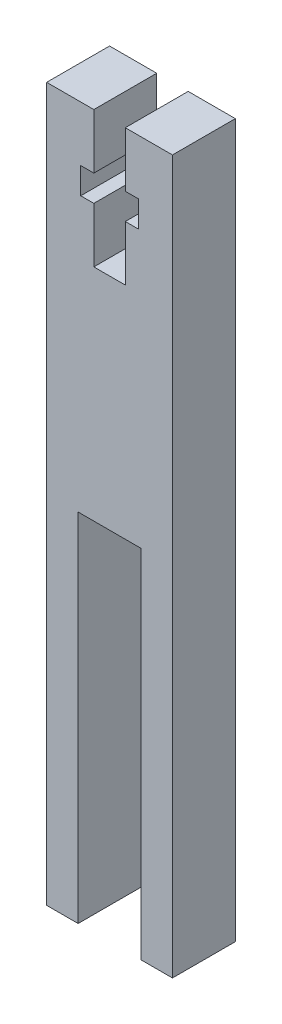
ISO-10303-21;
HEADER;
FILE_DESCRIPTION(('STEP AP214'),'2;1');
FILE_NAME('part.step','',(''),(''),'','','');
FILE_SCHEMA(('AUTOMOTIVE_DESIGN { 1 0 10303 214 1 1 1 1 }'));
ENDSEC;
DATA;
#1=APPLICATION_CONTEXT('core data for automotive mechanical design processes');
#2=APPLICATION_PROTOCOL_DEFINITION('international standard','automotive_design',2000,#1);
#3=PRODUCT_CONTEXT('',#1,'mechanical');
#4=PRODUCT('Part','Part','',(#3));
#5=PRODUCT_RELATED_PRODUCT_CATEGORY('part','',(#4));
#6=PRODUCT_DEFINITION_FORMATION('','',#4);
#7=PRODUCT_DEFINITION_CONTEXT('part definition',#1,'design');
#8=PRODUCT_DEFINITION('design','',#6,#7);
#9=PRODUCT_DEFINITION_SHAPE('','',#8);
#10=(LENGTH_UNIT() NAMED_UNIT(*) SI_UNIT(.MILLI.,.METRE.));
#11=(NAMED_UNIT(*) PLANE_ANGLE_UNIT() SI_UNIT($,.RADIAN.));
#12=(NAMED_UNIT(*) SI_UNIT($,.STERADIAN.) SOLID_ANGLE_UNIT());
#13=UNCERTAINTY_MEASURE_WITH_UNIT(LENGTH_MEASURE(1.E-05),#10,'distance_accuracy_value','');
#14=(GEOMETRIC_REPRESENTATION_CONTEXT(3) GLOBAL_UNCERTAINTY_ASSIGNED_CONTEXT((#13)) GLOBAL_UNIT_ASSIGNED_CONTEXT((#10,
#11,#12)) REPRESENTATION_CONTEXT('',''));
#15=CARTESIAN_POINT('',(0.,0.,0.));
#16=DIRECTION('',(0.,0.,1.));
#17=DIRECTION('',(1.,0.,0.));
#18=AXIS2_PLACEMENT_3D('',#15,#16,#17);
#19=CARTESIAN_POINT('',(-1.5,68.,6.));
#20=DIRECTION('',(0.,-1.,0.));
#21=DIRECTION('',(1.,0.,0.));
#22=AXIS2_PLACEMENT_3D('',#19,#20,#21);
#23=PLANE('',#22);
#24=DIRECTION('',(-1.,0.,0.));
#25=VECTOR('',#24,1.);
#26=CARTESIAN_POINT('',(-1.5,68.,0.));
#27=LINE('',#26,#25);
#28=CARTESIAN_POINT('',(-1.5,68.,0.));
#29=VERTEX_POINT('',#28);
#30=CARTESIAN_POINT('',(-6.,68.,0.));
#31=VERTEX_POINT('',#30);
#32=EDGE_CURVE('E212',#29,#31,#27,.T.);
#33=ORIENTED_EDGE('',*,*,#32,.T.);
#34=DIRECTION('',(0.,0.,-1.));
#35=VECTOR('',#34,1.);
#36=CARTESIAN_POINT('',(-6.,68.,6.));
#37=LINE('',#36,#35);
#38=CARTESIAN_POINT('',(-6.,68.,6.));
#39=VERTEX_POINT('',#38);
#40=EDGE_CURVE('E11',#39,#31,#37,.T.);
#41=ORIENTED_EDGE('',*,*,#40,.F.);
#42=DIRECTION('',(-1.,0.,0.));
#43=VECTOR('',#42,1.);
#44=CARTESIAN_POINT('',(-1.5,68.,6.));
#45=LINE('',#44,#43);
#46=CARTESIAN_POINT('',(-1.5,68.,6.));
#47=VERTEX_POINT('',#46);
#48=EDGE_CURVE('E270',#47,#39,#45,.T.);
#49=ORIENTED_EDGE('',*,*,#48,.F.);
#50=DIRECTION('',(0.,0.,-1.));
#51=VECTOR('',#50,1.);
#52=CARTESIAN_POINT('',(-1.5,68.,6.));
#53=LINE('',#52,#51);
#54=EDGE_CURVE('E208',#47,#29,#53,.T.);
#55=ORIENTED_EDGE('',*,*,#54,.T.);
#56=EDGE_LOOP('',(#33,#41,#49,#55));
#57=FACE_BOUND('',#56,.T.);
#58=ADVANCED_FACE('F39',(#57),#23,.F.);
#59=CARTESIAN_POINT('',(-6.,68.,6.));
#60=DIRECTION('',(1.,0.,0.));
#61=DIRECTION('',(0.,1.,0.));
#62=AXIS2_PLACEMENT_3D('',#59,#60,#61);
#63=PLANE('',#62);
#64=DIRECTION('',(0.,-1.,0.));
#65=VECTOR('',#64,1.);
#66=CARTESIAN_POINT('',(-6.,68.,0.));
#67=LINE('',#66,#65);
#68=CARTESIAN_POINT('',(-5.99999999999999,0.,0.));
#69=VERTEX_POINT('',#68);
#70=EDGE_CURVE('E216',#31,#69,#67,.T.);
#71=ORIENTED_EDGE('',*,*,#70,.T.);
#72=DIRECTION('',(0.,0.,-1.));
#73=VECTOR('',#72,1.);
#74=CARTESIAN_POINT('',(-5.99999999999999,0.,6.));
#75=LINE('',#74,#73);
#76=CARTESIAN_POINT('',(-5.99999999999999,0.,6.));
#77=VERTEX_POINT('',#76);
#78=EDGE_CURVE('E48',#77,#69,#75,.T.);
#79=ORIENTED_EDGE('',*,*,#78,.F.);
#80=DIRECTION('',(0.,-1.,0.));
#81=VECTOR('',#80,1.);
#82=CARTESIAN_POINT('',(-6.,68.,6.));
#83=LINE('',#82,#81);
#84=EDGE_CURVE('E135',#39,#77,#83,.T.);
#85=ORIENTED_EDGE('',*,*,#84,.F.);
#86=ORIENTED_EDGE('',*,*,#40,.T.);
#87=EDGE_LOOP('',(#71,#79,#85,#86));
#88=FACE_BOUND('',#87,.T.);
#89=ADVANCED_FACE('F420',(#88),#63,.F.);
#90=CARTESIAN_POINT('',(-5.99999999999999,0.,6.));
#91=DIRECTION('',(0.,1.,0.));
#92=DIRECTION('',(0.,0.,1.));
#93=AXIS2_PLACEMENT_3D('',#90,#91,#92);
#94=PLANE('',#93);
#95=DIRECTION('',(1.,0.,0.));
#96=VECTOR('',#95,1.);
#97=CARTESIAN_POINT('',(-5.99999999999999,0.,0.));
#98=LINE('',#97,#96);
#99=CARTESIAN_POINT('',(-3.,0.,0.));
#100=VERTEX_POINT('',#99);
#101=EDGE_CURVE('E219',#69,#100,#98,.T.);
#102=ORIENTED_EDGE('',*,*,#101,.T.);
#103=DIRECTION('',(0.,0.,-1.));
#104=VECTOR('',#103,1.);
#105=CARTESIAN_POINT('',(-3.,0.,6.));
#106=LINE('',#105,#104);
#107=CARTESIAN_POINT('',(-3.,0.,6.));
#108=VERTEX_POINT('',#107);
#109=EDGE_CURVE('E329',#108,#100,#106,.T.);
#110=ORIENTED_EDGE('',*,*,#109,.F.);
#111=DIRECTION('',(1.,0.,0.));
#112=VECTOR('',#111,1.);
#113=CARTESIAN_POINT('',(-5.99999999999999,0.,6.));
#114=LINE('',#113,#112);
#115=EDGE_CURVE('E339',#77,#108,#114,.T.);
#116=ORIENTED_EDGE('',*,*,#115,.F.);
#117=ORIENTED_EDGE('',*,*,#78,.T.);
#118=EDGE_LOOP('',(#102,#110,#116,#117));
#119=FACE_BOUND('',#118,.T.);
#120=ADVANCED_FACE('F337',(#119),#94,.F.);
#121=CARTESIAN_POINT('',(-3.,0.,6.));
#122=DIRECTION('',(-1.,0.,0.));
#123=DIRECTION('',(0.,0.,1.));
#124=AXIS2_PLACEMENT_3D('',#121,#122,#123);
#125=PLANE('',#124);
#126=DIRECTION('',(0.,1.,0.));
#127=VECTOR('',#126,1.);
#128=CARTESIAN_POINT('',(-3.,0.,0.));
#129=LINE('',#128,#127);
#130=CARTESIAN_POINT('',(-3.,34.,0.));
#131=VERTEX_POINT('',#130);
#132=EDGE_CURVE('E222',#100,#131,#129,.T.);
#133=ORIENTED_EDGE('',*,*,#132,.T.);
#134=DIRECTION('',(0.,0.,-1.));
#135=VECTOR('',#134,1.);
#136=CARTESIAN_POINT('',(-3.,34.,6.));
#137=LINE('',#136,#135);
#138=CARTESIAN_POINT('',(-3.,34.,6.));
#139=VERTEX_POINT('',#138);
#140=EDGE_CURVE('E325',#139,#131,#137,.T.);
#141=ORIENTED_EDGE('',*,*,#140,.F.);
#142=DIRECTION('',(0.,1.,0.));
#143=VECTOR('',#142,1.);
#144=CARTESIAN_POINT('',(-3.,0.,6.));
#145=LINE('',#144,#143);
#146=EDGE_CURVE('E358',#108,#139,#145,.T.);
#147=ORIENTED_EDGE('',*,*,#146,.F.);
#148=ORIENTED_EDGE('',*,*,#109,.T.);
#149=EDGE_LOOP('',(#133,#141,#147,#148));
#150=FACE_BOUND('',#149,.T.);
#151=ADVANCED_FACE('F348',(#150),#125,.F.);
#152=CARTESIAN_POINT('',(-3.,34.,6.));
#153=DIRECTION('',(0.,1.,0.));
#154=DIRECTION('',(0.,0.,1.));
#155=AXIS2_PLACEMENT_3D('',#152,#153,#154);
#156=PLANE('',#155);
#157=DIRECTION('',(1.,0.,0.));
#158=VECTOR('',#157,1.);
#159=CARTESIAN_POINT('',(-3.,34.,0.));
#160=LINE('',#159,#158);
#161=CARTESIAN_POINT('',(3.,34.,0.));
#162=VERTEX_POINT('',#161);
#163=EDGE_CURVE('E225',#131,#162,#160,.T.);
#164=ORIENTED_EDGE('',*,*,#163,.T.);
#165=DIRECTION('',(0.,0.,-1.));
#166=VECTOR('',#165,1.);
#167=CARTESIAN_POINT('',(3.,34.,6.));
#168=LINE('',#167,#166);
#169=CARTESIAN_POINT('',(3.,34.,6.));
#170=VERTEX_POINT('',#169);
#171=EDGE_CURVE('E321',#170,#162,#168,.T.);
#172=ORIENTED_EDGE('',*,*,#171,.F.);
#173=DIRECTION('',(1.,0.,0.));
#174=VECTOR('',#173,1.);
#175=CARTESIAN_POINT('',(-3.,34.,6.));
#176=LINE('',#175,#174);
#177=EDGE_CURVE('E354',#139,#170,#176,.T.);
#178=ORIENTED_EDGE('',*,*,#177,.F.);
#179=ORIENTED_EDGE('',*,*,#140,.T.);
#180=EDGE_LOOP('',(#164,#172,#178,#179));
#181=FACE_BOUND('',#180,.T.);
#182=ADVANCED_FACE('F352',(#181),#156,.F.);
#183=CARTESIAN_POINT('',(3.,0.,6.));
#184=DIRECTION('',(1.,0.,0.));
#185=DIRECTION('',(0.,0.,-1.));
#186=AXIS2_PLACEMENT_3D('',#183,#184,#185);
#187=PLANE('',#186);
#188=DIRECTION('',(0.,-1.,0.));
#189=VECTOR('',#188,1.);
#190=CARTESIAN_POINT('',(3.,0.,0.));
#191=LINE('',#190,#189);
#192=CARTESIAN_POINT('',(3.,0.,0.));
#193=VERTEX_POINT('',#192);
#194=EDGE_CURVE('E228',#162,#193,#191,.T.);
#195=ORIENTED_EDGE('',*,*,#194,.T.);
#196=DIRECTION('',(0.,0.,-1.));
#197=VECTOR('',#196,1.);
#198=CARTESIAN_POINT('',(3.,0.,6.));
#199=LINE('',#198,#197);
#200=CARTESIAN_POINT('',(3.,0.,6.));
#201=VERTEX_POINT('',#200);
#202=EDGE_CURVE('E317',#201,#193,#199,.T.);
#203=ORIENTED_EDGE('',*,*,#202,.F.);
#204=DIRECTION('',(0.,-1.,0.));
#205=VECTOR('',#204,1.);
#206=CARTESIAN_POINT('',(3.,0.,6.));
#207=LINE('',#206,#205);
#208=EDGE_CURVE('E357',#170,#201,#207,.T.);
#209=ORIENTED_EDGE('',*,*,#208,.F.);
#210=ORIENTED_EDGE('',*,*,#171,.T.);
#211=EDGE_LOOP('',(#195,#203,#209,#210));
#212=FACE_BOUND('',#211,.T.);
#213=ADVANCED_FACE('F433',(#212),#187,.F.);
#214=CARTESIAN_POINT('',(5.99999999999999,0.,6.));
#215=DIRECTION('',(0.,1.,0.));
#216=DIRECTION('',(0.,0.,1.));
#217=AXIS2_PLACEMENT_3D('',#214,#215,#216);
#218=PLANE('',#217);
#219=DIRECTION('',(1.,0.,0.));
#220=VECTOR('',#219,1.);
#221=CARTESIAN_POINT('',(5.99999999999999,0.,0.));
#222=LINE('',#221,#220);
#223=CARTESIAN_POINT('',(5.99999999999999,0.,0.));
#224=VERTEX_POINT('',#223);
#225=EDGE_CURVE('E231',#193,#224,#222,.T.);
#226=ORIENTED_EDGE('',*,*,#225,.T.);
#227=DIRECTION('',(0.,0.,-1.));
#228=VECTOR('',#227,1.);
#229=CARTESIAN_POINT('',(5.99999999999999,0.,6.));
#230=LINE('',#229,#228);
#231=CARTESIAN_POINT('',(5.99999999999999,0.,6.));
#232=VERTEX_POINT('',#231);
#233=EDGE_CURVE('E313',#232,#224,#230,.T.);
#234=ORIENTED_EDGE('',*,*,#233,.F.);
#235=DIRECTION('',(1.,0.,0.));
#236=VECTOR('',#235,1.);
#237=CARTESIAN_POINT('',(5.99999999999999,0.,6.));
#238=LINE('',#237,#236);
#239=EDGE_CURVE('E362',#201,#232,#238,.T.);
#240=ORIENTED_EDGE('',*,*,#239,.F.);
#241=ORIENTED_EDGE('',*,*,#202,.T.);
#242=EDGE_LOOP('',(#226,#234,#240,#241));
#243=FACE_BOUND('',#242,.T.);
#244=ADVANCED_FACE('F436',(#243),#218,.F.);
#245=CARTESIAN_POINT('',(6.,68.,6.));
#246=DIRECTION('',(-1.,0.,0.));
#247=DIRECTION('',(0.,-1.,0.));
#248=AXIS2_PLACEMENT_3D('',#245,#246,#247);
#249=PLANE('',#248);
#250=DIRECTION('',(0.,1.,0.));
#251=VECTOR('',#250,1.);
#252=CARTESIAN_POINT('',(6.,68.,0.));
#253=LINE('',#252,#251);
#254=CARTESIAN_POINT('',(6.,68.,0.));
#255=VERTEX_POINT('',#254);
#256=EDGE_CURVE('E234',#224,#255,#253,.T.);
#257=ORIENTED_EDGE('',*,*,#256,.T.);
#258=DIRECTION('',(0.,0.,-1.));
#259=VECTOR('',#258,1.);
#260=CARTESIAN_POINT('',(6.,68.,6.));
#261=LINE('',#260,#259);
#262=CARTESIAN_POINT('',(6.,68.,6.));
#263=VERTEX_POINT('',#262);
#264=EDGE_CURVE('E309',#263,#255,#261,.T.);
#265=ORIENTED_EDGE('',*,*,#264,.F.);
#266=DIRECTION('',(0.,1.,0.));
#267=VECTOR('',#266,1.);
#268=CARTESIAN_POINT('',(6.,68.,6.));
#269=LINE('',#268,#267);
#270=EDGE_CURVE('E369',#232,#263,#269,.T.);
#271=ORIENTED_EDGE('',*,*,#270,.F.);
#272=ORIENTED_EDGE('',*,*,#233,.T.);
#273=EDGE_LOOP('',(#257,#265,#271,#272));
#274=FACE_BOUND('',#273,.T.);
#275=ADVANCED_FACE('F440',(#274),#249,.F.);
#276=CARTESIAN_POINT('',(1.5,68.,6.));
#277=DIRECTION('',(0.,-1.,0.));
#278=DIRECTION('',(1.,0.,0.));
#279=AXIS2_PLACEMENT_3D('',#276,#277,#278);
#280=PLANE('',#279);
#281=DIRECTION('',(-1.,0.,0.));
#282=VECTOR('',#281,1.);
#283=CARTESIAN_POINT('',(1.5,68.,0.));
#284=LINE('',#283,#282);
#285=CARTESIAN_POINT('',(1.5,68.,0.));
#286=VERTEX_POINT('',#285);
#287=EDGE_CURVE('E237',#255,#286,#284,.T.);
#288=ORIENTED_EDGE('',*,*,#287,.T.);
#289=DIRECTION('',(0.,0.,-1.));
#290=VECTOR('',#289,1.);
#291=CARTESIAN_POINT('',(1.5,68.,6.));
#292=LINE('',#291,#290);
#293=CARTESIAN_POINT('',(1.5,68.,6.));
#294=VERTEX_POINT('',#293);
#295=EDGE_CURVE('E305',#294,#286,#292,.T.);
#296=ORIENTED_EDGE('',*,*,#295,.F.);
#297=DIRECTION('',(-1.,0.,0.));
#298=VECTOR('',#297,1.);
#299=CARTESIAN_POINT('',(1.5,68.,6.));
#300=LINE('',#299,#298);
#301=EDGE_CURVE('E372',#263,#294,#300,.T.);
#302=ORIENTED_EDGE('',*,*,#301,.F.);
#303=ORIENTED_EDGE('',*,*,#264,.T.);
#304=EDGE_LOOP('',(#288,#296,#302,#303));
#305=FACE_BOUND('',#304,.T.);
#306=ADVANCED_FACE('F444',(#305),#280,.F.);
#307=CARTESIAN_POINT('',(1.5,68.,6.));
#308=DIRECTION('',(1.,0.,0.));
#309=DIRECTION('',(0.,1.,0.));
#310=AXIS2_PLACEMENT_3D('',#307,#308,#309);
#311=PLANE('',#310);
#312=DIRECTION('',(0.,-1.,0.));
#313=VECTOR('',#312,1.);
#314=CARTESIAN_POINT('',(1.5,68.,0.));
#315=LINE('',#314,#313);
#316=CARTESIAN_POINT('',(1.5,62.75,0.));
#317=VERTEX_POINT('',#316);
#318=EDGE_CURVE('E240',#286,#317,#315,.T.);
#319=ORIENTED_EDGE('',*,*,#318,.T.);
#320=DIRECTION('',(0.,0.,-1.));
#321=VECTOR('',#320,1.);
#322=CARTESIAN_POINT('',(1.5,62.75,6.));
#323=LINE('',#322,#321);
#324=CARTESIAN_POINT('',(1.5,62.75,6.));
#325=VERTEX_POINT('',#324);
#326=EDGE_CURVE('E301',#325,#317,#323,.T.);
#327=ORIENTED_EDGE('',*,*,#326,.F.);
#328=DIRECTION('',(0.,-1.,0.));
#329=VECTOR('',#328,1.);
#330=CARTESIAN_POINT('',(1.5,68.,6.));
#331=LINE('',#330,#329);
#332=EDGE_CURVE('E375',#294,#325,#331,.T.);
#333=ORIENTED_EDGE('',*,*,#332,.F.);
#334=ORIENTED_EDGE('',*,*,#295,.T.);
#335=EDGE_LOOP('',(#319,#327,#333,#334));
#336=FACE_BOUND('',#335,.T.);
#337=ADVANCED_FACE('F448',(#336),#311,.F.);
#338=CARTESIAN_POINT('',(1.5,62.75,6.));
#339=DIRECTION('',(0.,1.,0.));
#340=DIRECTION('',(0.,0.,1.));
#341=AXIS2_PLACEMENT_3D('',#338,#339,#340);
#342=PLANE('',#341);
#343=DIRECTION('',(1.,0.,0.));
#344=VECTOR('',#343,1.);
#345=CARTESIAN_POINT('',(1.5,62.75,0.));
#346=LINE('',#345,#344);
#347=CARTESIAN_POINT('',(2.75,62.75,0.));
#348=VERTEX_POINT('',#347);
#349=EDGE_CURVE('E243',#317,#348,#346,.T.);
#350=ORIENTED_EDGE('',*,*,#349,.T.);
#351=DIRECTION('',(0.,0.,-1.));
#352=VECTOR('',#351,1.);
#353=CARTESIAN_POINT('',(2.75,62.75,6.));
#354=LINE('',#353,#352);
#355=CARTESIAN_POINT('',(2.75,62.75,6.));
#356=VERTEX_POINT('',#355);
#357=EDGE_CURVE('E297',#356,#348,#354,.T.);
#358=ORIENTED_EDGE('',*,*,#357,.F.);
#359=DIRECTION('',(1.,0.,0.));
#360=VECTOR('',#359,1.);
#361=CARTESIAN_POINT('',(1.5,62.75,6.));
#362=LINE('',#361,#360);
#363=EDGE_CURVE('E378',#325,#356,#362,.T.);
#364=ORIENTED_EDGE('',*,*,#363,.F.);
#365=ORIENTED_EDGE('',*,*,#326,.T.);
#366=EDGE_LOOP('',(#350,#358,#364,#365));
#367=FACE_BOUND('',#366,.T.);
#368=ADVANCED_FACE('F452',(#367),#342,.F.);
#369=CARTESIAN_POINT('',(2.75,62.75,6.));
#370=DIRECTION('',(1.,0.,0.));
#371=DIRECTION('',(0.,0.,-1.));
#372=AXIS2_PLACEMENT_3D('',#369,#370,#371);
#373=PLANE('',#372);
#374=DIRECTION('',(0.,-1.,0.));
#375=VECTOR('',#374,1.);
#376=CARTESIAN_POINT('',(2.75,62.75,0.));
#377=LINE('',#376,#375);
#378=CARTESIAN_POINT('',(2.75,60.25,0.));
#379=VERTEX_POINT('',#378);
#380=EDGE_CURVE('E246',#348,#379,#377,.T.);
#381=ORIENTED_EDGE('',*,*,#380,.T.);
#382=DIRECTION('',(0.,0.,-1.));
#383=VECTOR('',#382,1.);
#384=CARTESIAN_POINT('',(2.75,60.25,6.));
#385=LINE('',#384,#383);
#386=CARTESIAN_POINT('',(2.75,60.25,6.));
#387=VERTEX_POINT('',#386);
#388=EDGE_CURVE('E293',#387,#379,#385,.T.);
#389=ORIENTED_EDGE('',*,*,#388,.F.);
#390=DIRECTION('',(0.,-1.,0.));
#391=VECTOR('',#390,1.);
#392=CARTESIAN_POINT('',(2.75,62.75,6.));
#393=LINE('',#392,#391);
#394=EDGE_CURVE('E381',#356,#387,#393,.T.);
#395=ORIENTED_EDGE('',*,*,#394,.F.);
#396=ORIENTED_EDGE('',*,*,#357,.T.);
#397=EDGE_LOOP('',(#381,#389,#395,#396));
#398=FACE_BOUND('',#397,.T.);
#399=ADVANCED_FACE('F456',(#398),#373,.F.);
#400=CARTESIAN_POINT('',(2.75,60.25,6.));
#401=DIRECTION('',(0.,-1.,0.));
#402=DIRECTION('',(0.,0.,-1.));
#403=AXIS2_PLACEMENT_3D('',#400,#401,#402);
#404=PLANE('',#403);
#405=DIRECTION('',(-1.,0.,0.));
#406=VECTOR('',#405,1.);
#407=CARTESIAN_POINT('',(2.75,60.25,0.));
#408=LINE('',#407,#406);
#409=CARTESIAN_POINT('',(1.5,60.25,0.));
#410=VERTEX_POINT('',#409);
#411=EDGE_CURVE('E249',#379,#410,#408,.T.);
#412=ORIENTED_EDGE('',*,*,#411,.T.);
#413=DIRECTION('',(0.,0.,-1.));
#414=VECTOR('',#413,1.);
#415=CARTESIAN_POINT('',(1.5,60.25,6.));
#416=LINE('',#415,#414);
#417=CARTESIAN_POINT('',(1.5,60.25,6.));
#418=VERTEX_POINT('',#417);
#419=EDGE_CURVE('E289',#418,#410,#416,.T.);
#420=ORIENTED_EDGE('',*,*,#419,.F.);
#421=DIRECTION('',(-1.,0.,0.));
#422=VECTOR('',#421,1.);
#423=CARTESIAN_POINT('',(2.75,60.25,6.));
#424=LINE('',#423,#422);
#425=EDGE_CURVE('E384',#387,#418,#424,.T.);
#426=ORIENTED_EDGE('',*,*,#425,.F.);
#427=ORIENTED_EDGE('',*,*,#388,.T.);
#428=EDGE_LOOP('',(#412,#420,#426,#427));
#429=FACE_BOUND('',#428,.T.);
#430=ADVANCED_FACE('F460',(#429),#404,.F.);
#431=CARTESIAN_POINT('',(1.5,60.25,6.));
#432=DIRECTION('',(1.,0.,0.));
#433=DIRECTION('',(0.,1.,0.));
#434=AXIS2_PLACEMENT_3D('',#431,#432,#433);
#435=PLANE('',#434);
#436=DIRECTION('',(0.,-1.,0.));
#437=VECTOR('',#436,1.);
#438=CARTESIAN_POINT('',(1.5,60.25,0.));
#439=LINE('',#438,#437);
#440=CARTESIAN_POINT('',(1.5,55.0000000000001,0.));
#441=VERTEX_POINT('',#440);
#442=EDGE_CURVE('E252',#410,#441,#439,.T.);
#443=ORIENTED_EDGE('',*,*,#442,.T.);
#444=DIRECTION('',(0.,0.,-1.));
#445=VECTOR('',#444,1.);
#446=CARTESIAN_POINT('',(1.5,55.0000000000001,6.));
#447=LINE('',#446,#445);
#448=CARTESIAN_POINT('',(1.5,55.0000000000001,6.));
#449=VERTEX_POINT('',#448);
#450=EDGE_CURVE('E285',#449,#441,#447,.T.);
#451=ORIENTED_EDGE('',*,*,#450,.F.);
#452=DIRECTION('',(0.,-1.,0.));
#453=VECTOR('',#452,1.);
#454=CARTESIAN_POINT('',(1.5,60.25,6.));
#455=LINE('',#454,#453);
#456=EDGE_CURVE('E387',#418,#449,#455,.T.);
#457=ORIENTED_EDGE('',*,*,#456,.F.);
#458=ORIENTED_EDGE('',*,*,#419,.T.);
#459=EDGE_LOOP('',(#443,#451,#457,#458));
#460=FACE_BOUND('',#459,.T.);
#461=ADVANCED_FACE('F464',(#460),#435,.F.);
#462=CARTESIAN_POINT('',(-1.5,55.,6.));
#463=DIRECTION('',(0.,-1.,0.));
#464=DIRECTION('',(1.,0.,0.));
#465=AXIS2_PLACEMENT_3D('',#462,#463,#464);
#466=PLANE('',#465);
#467=DIRECTION('',(-1.,0.,0.));
#468=VECTOR('',#467,1.);
#469=CARTESIAN_POINT('',(-1.5,55.,0.));
#470=LINE('',#469,#468);
#471=CARTESIAN_POINT('',(-1.5,55.,0.));
#472=VERTEX_POINT('',#471);
#473=EDGE_CURVE('E255',#441,#472,#470,.T.);
#474=ORIENTED_EDGE('',*,*,#473,.T.);
#475=DIRECTION('',(0.,0.,-1.));
#476=VECTOR('',#475,1.);
#477=CARTESIAN_POINT('',(-1.5,55.,6.));
#478=LINE('',#477,#476);
#479=CARTESIAN_POINT('',(-1.5,55.,6.));
#480=VERTEX_POINT('',#479);
#481=EDGE_CURVE('E281',#480,#472,#478,.T.);
#482=ORIENTED_EDGE('',*,*,#481,.F.);
#483=DIRECTION('',(-1.,0.,0.));
#484=VECTOR('',#483,1.);
#485=CARTESIAN_POINT('',(-1.5,55.,6.));
#486=LINE('',#485,#484);
#487=EDGE_CURVE('E390',#449,#480,#486,.T.);
#488=ORIENTED_EDGE('',*,*,#487,.F.);
#489=ORIENTED_EDGE('',*,*,#450,.T.);
#490=EDGE_LOOP('',(#474,#482,#488,#489));
#491=FACE_BOUND('',#490,.T.);
#492=ADVANCED_FACE('F468',(#491),#466,.F.);
#493=CARTESIAN_POINT('',(-1.5,60.25,6.));
#494=DIRECTION('',(-1.,0.,0.));
#495=DIRECTION('',(0.,-1.,0.));
#496=AXIS2_PLACEMENT_3D('',#493,#494,#495);
#497=PLANE('',#496);
#498=DIRECTION('',(0.,1.,0.));
#499=VECTOR('',#498,1.);
#500=CARTESIAN_POINT('',(-1.5,60.25,0.));
#501=LINE('',#500,#499);
#502=CARTESIAN_POINT('',(-1.5,60.25,0.));
#503=VERTEX_POINT('',#502);
#504=EDGE_CURVE('E258',#472,#503,#501,.T.);
#505=ORIENTED_EDGE('',*,*,#504,.T.);
#506=DIRECTION('',(0.,0.,-1.));
#507=VECTOR('',#506,1.);
#508=CARTESIAN_POINT('',(-1.5,60.25,6.));
#509=LINE('',#508,#507);
#510=CARTESIAN_POINT('',(-1.5,60.25,6.));
#511=VERTEX_POINT('',#510);
#512=EDGE_CURVE('E277',#511,#503,#509,.T.);
#513=ORIENTED_EDGE('',*,*,#512,.F.);
#514=DIRECTION('',(0.,1.,0.));
#515=VECTOR('',#514,1.);
#516=CARTESIAN_POINT('',(-1.5,60.25,6.));
#517=LINE('',#516,#515);
#518=EDGE_CURVE('E393',#480,#511,#517,.T.);
#519=ORIENTED_EDGE('',*,*,#518,.F.);
#520=ORIENTED_EDGE('',*,*,#481,.T.);
#521=EDGE_LOOP('',(#505,#513,#519,#520));
#522=FACE_BOUND('',#521,.T.);
#523=ADVANCED_FACE('F401',(#522),#497,.F.);
#524=CARTESIAN_POINT('',(-2.75,60.25,6.));
#525=DIRECTION('',(0.,-1.,0.));
#526=DIRECTION('',(0.,0.,-1.));
#527=AXIS2_PLACEMENT_3D('',#524,#525,#526);
#528=PLANE('',#527);
#529=DIRECTION('',(-1.,0.,0.));
#530=VECTOR('',#529,1.);
#531=CARTESIAN_POINT('',(-2.75,60.25,0.));
#532=LINE('',#531,#530);
#533=CARTESIAN_POINT('',(-2.75,60.25,0.));
#534=VERTEX_POINT('',#533);
#535=EDGE_CURVE('E261',#503,#534,#532,.T.);
#536=ORIENTED_EDGE('',*,*,#535,.T.);
#537=DIRECTION('',(0.,0.,-1.));
#538=VECTOR('',#537,1.);
#539=CARTESIAN_POINT('',(-2.75,60.25,6.));
#540=LINE('',#539,#538);
#541=CARTESIAN_POINT('',(-2.75,60.25,6.));
#542=VERTEX_POINT('',#541);
#543=EDGE_CURVE('E201',#542,#534,#540,.T.);
#544=ORIENTED_EDGE('',*,*,#543,.F.);
#545=DIRECTION('',(-1.,0.,0.));
#546=VECTOR('',#545,1.);
#547=CARTESIAN_POINT('',(-2.75,60.25,6.));
#548=LINE('',#547,#546);
#549=EDGE_CURVE('E190',#511,#542,#548,.T.);
#550=ORIENTED_EDGE('',*,*,#549,.F.);
#551=ORIENTED_EDGE('',*,*,#512,.T.);
#552=EDGE_LOOP('',(#536,#544,#550,#551));
#553=FACE_BOUND('',#552,.T.);
#554=ADVANCED_FACE('F405',(#553),#528,.F.);
#555=CARTESIAN_POINT('',(-2.75,62.75,6.));
#556=DIRECTION('',(-1.,0.,0.));
#557=DIRECTION('',(0.,0.,1.));
#558=AXIS2_PLACEMENT_3D('',#555,#556,#557);
#559=PLANE('',#558);
#560=DIRECTION('',(0.,1.,0.));
#561=VECTOR('',#560,1.);
#562=CARTESIAN_POINT('',(-2.75,62.75,0.));
#563=LINE('',#562,#561);
#564=CARTESIAN_POINT('',(-2.75,62.75,0.));
#565=VERTEX_POINT('',#564);
#566=EDGE_CURVE('E199',#534,#565,#563,.T.);
#567=ORIENTED_EDGE('',*,*,#566,.T.);
#568=DIRECTION('',(0.,0.,-1.));
#569=VECTOR('',#568,1.);
#570=CARTESIAN_POINT('',(-2.75,62.75,6.));
#571=LINE('',#570,#569);
#572=CARTESIAN_POINT('',(-2.75,62.75,6.));
#573=VERTEX_POINT('',#572);
#574=EDGE_CURVE('E196',#573,#565,#571,.T.);
#575=ORIENTED_EDGE('',*,*,#574,.F.);
#576=DIRECTION('',(0.,1.,0.));
#577=VECTOR('',#576,1.);
#578=CARTESIAN_POINT('',(-2.75,62.75,6.));
#579=LINE('',#578,#577);
#580=EDGE_CURVE('E184',#542,#573,#579,.T.);
#581=ORIENTED_EDGE('',*,*,#580,.F.);
#582=ORIENTED_EDGE('',*,*,#543,.T.);
#583=EDGE_LOOP('',(#567,#575,#581,#582));
#584=FACE_BOUND('',#583,.T.);
#585=ADVANCED_FACE('F197',(#584),#559,.F.);
#586=CARTESIAN_POINT('',(-1.5,62.75,6.));
#587=DIRECTION('',(0.,1.,0.));
#588=DIRECTION('',(0.,0.,1.));
#589=AXIS2_PLACEMENT_3D('',#586,#587,#588);
#590=PLANE('',#589);
#591=DIRECTION('',(1.,0.,0.));
#592=VECTOR('',#591,1.);
#593=CARTESIAN_POINT('',(-1.5,62.75,0.));
#594=LINE('',#593,#592);
#595=CARTESIAN_POINT('',(-1.5,62.75,0.));
#596=VERTEX_POINT('',#595);
#597=EDGE_CURVE('E121',#565,#596,#594,.T.);
#598=ORIENTED_EDGE('',*,*,#597,.T.);
#599=DIRECTION('',(0.,0.,-1.));
#600=VECTOR('',#599,1.);
#601=CARTESIAN_POINT('',(-1.5,62.75,6.));
#602=LINE('',#601,#600);
#603=CARTESIAN_POINT('',(-1.5,62.75,6.));
#604=VERTEX_POINT('',#603);
#605=EDGE_CURVE('E202',#604,#596,#602,.T.);
#606=ORIENTED_EDGE('',*,*,#605,.F.);
#607=DIRECTION('',(1.,0.,0.));
#608=VECTOR('',#607,1.);
#609=CARTESIAN_POINT('',(-1.5,62.75,6.));
#610=LINE('',#609,#608);
#611=EDGE_CURVE('E188',#573,#604,#610,.T.);
#612=ORIENTED_EDGE('',*,*,#611,.F.);
#613=ORIENTED_EDGE('',*,*,#574,.T.);
#614=EDGE_LOOP('',(#598,#606,#612,#613));
#615=FACE_BOUND('',#614,.T.);
#616=ADVANCED_FACE('F204',(#615),#590,.F.);
#617=CARTESIAN_POINT('',(-1.5,68.,6.));
#618=DIRECTION('',(-1.,0.,0.));
#619=DIRECTION('',(0.,-1.,0.));
#620=AXIS2_PLACEMENT_3D('',#617,#618,#619);
#621=PLANE('',#620);
#622=DIRECTION('',(0.,1.,0.));
#623=VECTOR('',#622,1.);
#624=CARTESIAN_POINT('',(-1.5,68.,0.));
#625=LINE('',#624,#623);
#626=EDGE_CURVE('E127',#596,#29,#625,.T.);
#627=ORIENTED_EDGE('',*,*,#626,.T.);
#628=ORIENTED_EDGE('',*,*,#54,.F.);
#629=DIRECTION('',(0.,1.,0.));
#630=VECTOR('',#629,1.);
#631=CARTESIAN_POINT('',(-1.5,68.,6.));
#632=LINE('',#631,#630);
#633=EDGE_CURVE('E56',#604,#47,#632,.T.);
#634=ORIENTED_EDGE('',*,*,#633,.F.);
#635=ORIENTED_EDGE('',*,*,#605,.T.);
#636=EDGE_LOOP('',(#627,#628,#634,#635));
#637=FACE_BOUND('',#636,.T.);
#638=ADVANCED_FACE('F409',(#637),#621,.F.);
#639=CARTESIAN_POINT('',(0.,0.,6.));
#640=DIRECTION('',(0.,0.,1.));
#641=DIRECTION('',(1.,0.,0.));
#642=AXIS2_PLACEMENT_3D('',#639,#640,#641);
#643=PLANE('',#642);
#644=ORIENTED_EDGE('',*,*,#48,.T.);
#645=ORIENTED_EDGE('',*,*,#84,.T.);
#646=ORIENTED_EDGE('',*,*,#115,.T.);
#647=ORIENTED_EDGE('',*,*,#146,.T.);
#648=ORIENTED_EDGE('',*,*,#177,.T.);
#649=ORIENTED_EDGE('',*,*,#208,.T.);
#650=ORIENTED_EDGE('',*,*,#239,.T.);
#651=ORIENTED_EDGE('',*,*,#270,.T.);
#652=ORIENTED_EDGE('',*,*,#301,.T.);
#653=ORIENTED_EDGE('',*,*,#332,.T.);
#654=ORIENTED_EDGE('',*,*,#363,.T.);
#655=ORIENTED_EDGE('',*,*,#394,.T.);
#656=ORIENTED_EDGE('',*,*,#425,.T.);
#657=ORIENTED_EDGE('',*,*,#456,.T.);
#658=ORIENTED_EDGE('',*,*,#487,.T.);
#659=ORIENTED_EDGE('',*,*,#518,.T.);
#660=ORIENTED_EDGE('',*,*,#549,.T.);
#661=ORIENTED_EDGE('',*,*,#580,.T.);
#662=ORIENTED_EDGE('',*,*,#611,.T.);
#663=ORIENTED_EDGE('',*,*,#633,.T.);
#664=EDGE_LOOP('',(#644,#645,#646,#647,#648,#649,#650,#651,#652,#653,#654,#655,#656,#657,#658,
#659,#660,#661,#662,#663));
#665=FACE_BOUND('',#664,.T.);
#666=ADVANCED_FACE('F186',(#665),#643,.T.);
#667=CARTESIAN_POINT('',(0.,0.,0.));
#668=DIRECTION('',(0.,0.,1.));
#669=DIRECTION('',(1.,0.,0.));
#670=AXIS2_PLACEMENT_3D('',#667,#668,#669);
#671=PLANE('',#670);
#672=ORIENTED_EDGE('',*,*,#32,.F.);
#673=ORIENTED_EDGE('',*,*,#626,.F.);
#674=ORIENTED_EDGE('',*,*,#597,.F.);
#675=ORIENTED_EDGE('',*,*,#566,.F.);
#676=ORIENTED_EDGE('',*,*,#535,.F.);
#677=ORIENTED_EDGE('',*,*,#504,.F.);
#678=ORIENTED_EDGE('',*,*,#473,.F.);
#679=ORIENTED_EDGE('',*,*,#442,.F.);
#680=ORIENTED_EDGE('',*,*,#411,.F.);
#681=ORIENTED_EDGE('',*,*,#380,.F.);
#682=ORIENTED_EDGE('',*,*,#349,.F.);
#683=ORIENTED_EDGE('',*,*,#318,.F.);
#684=ORIENTED_EDGE('',*,*,#287,.F.);
#685=ORIENTED_EDGE('',*,*,#256,.F.);
#686=ORIENTED_EDGE('',*,*,#225,.F.);
#687=ORIENTED_EDGE('',*,*,#194,.F.);
#688=ORIENTED_EDGE('',*,*,#163,.F.);
#689=ORIENTED_EDGE('',*,*,#132,.F.);
#690=ORIENTED_EDGE('',*,*,#101,.F.);
#691=ORIENTED_EDGE('',*,*,#70,.F.);
#692=EDGE_LOOP('',(#672,#673,#674,#675,#676,#677,#678,#679,#680,#681,#682,#683,#684,#685,#686,
#687,#688,#689,#690,#691));
#693=FACE_BOUND('',#692,.T.);
#694=ADVANCED_FACE('F343',(#693),#671,.F.);
#695=CLOSED_SHELL('',(#58,#89,#120,#151,#182,#213,#244,#275,#306,#337,#368,#399,#430,#461,#492,
#523,#554,#585,#616,#638,#666,#694));
#696=MANIFOLD_SOLID_BREP('B2',#695);
#697=ADVANCED_BREP_SHAPE_REPRESENTATION('',(#18,#696),#14);
#698=SHAPE_DEFINITION_REPRESENTATION(#9,#697);
ENDSEC;
END-ISO-10303-21;
